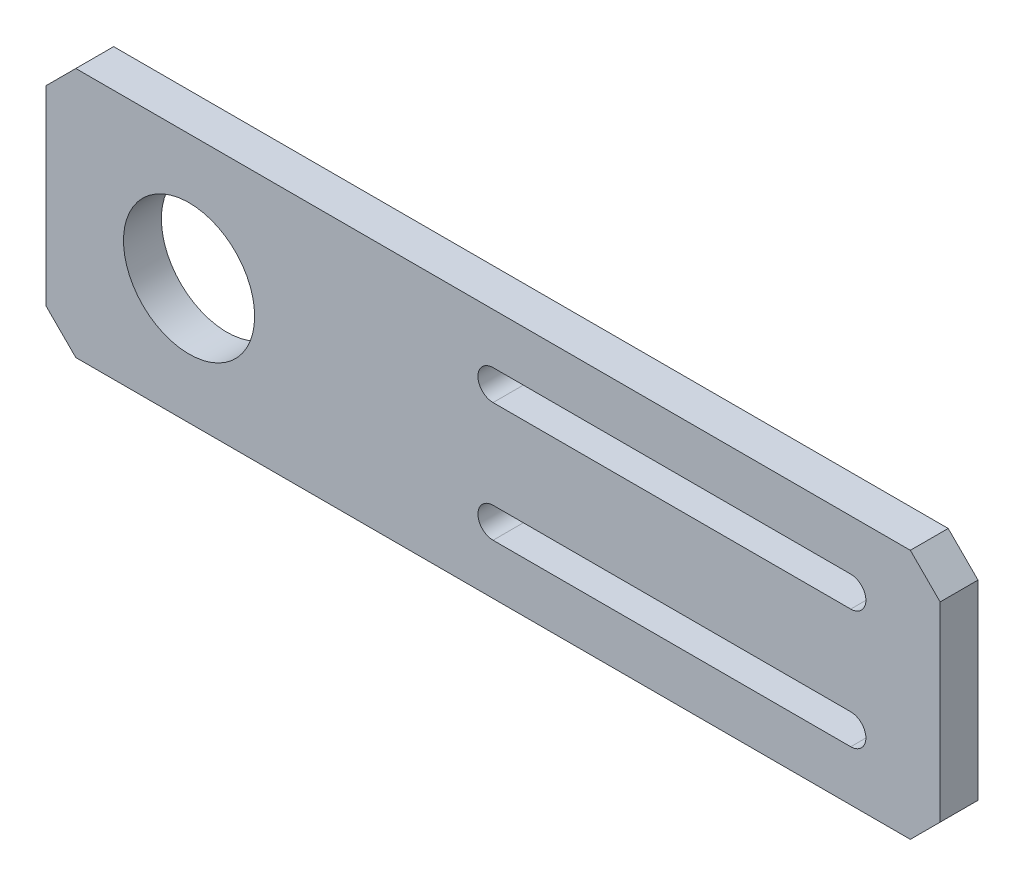
ISO-10303-21;
HEADER;
FILE_DESCRIPTION(('STEP AP214'),'2;1');
FILE_NAME('part.step','',(''),(''),'','','');
FILE_SCHEMA(('AUTOMOTIVE_DESIGN { 1 0 10303 214 1 1 1 1 }'));
ENDSEC;
DATA;
#1=APPLICATION_CONTEXT('core data for automotive mechanical design processes');
#2=APPLICATION_PROTOCOL_DEFINITION('international standard','automotive_design',2000,#1);
#3=PRODUCT_CONTEXT('',#1,'mechanical');
#4=PRODUCT('Part','Part','',(#3));
#5=PRODUCT_RELATED_PRODUCT_CATEGORY('part','',(#4));
#6=PRODUCT_DEFINITION_FORMATION('','',#4);
#7=PRODUCT_DEFINITION_CONTEXT('part definition',#1,'design');
#8=PRODUCT_DEFINITION('design','',#6,#7);
#9=PRODUCT_DEFINITION_SHAPE('','',#8);
#10=(LENGTH_UNIT() NAMED_UNIT(*) SI_UNIT(.MILLI.,.METRE.));
#11=(NAMED_UNIT(*) PLANE_ANGLE_UNIT() SI_UNIT($,.RADIAN.));
#12=(NAMED_UNIT(*) SI_UNIT($,.STERADIAN.) SOLID_ANGLE_UNIT());
#13=UNCERTAINTY_MEASURE_WITH_UNIT(LENGTH_MEASURE(1.E-05),#10,'distance_accuracy_value','');
#14=(GEOMETRIC_REPRESENTATION_CONTEXT(3) GLOBAL_UNCERTAINTY_ASSIGNED_CONTEXT((#13)) GLOBAL_UNIT_ASSIGNED_CONTEXT((#10,
#11,#12)) REPRESENTATION_CONTEXT('',''));
#15=CARTESIAN_POINT('',(0.,0.,0.));
#16=DIRECTION('',(0.,0.,1.));
#17=DIRECTION('',(1.,0.,0.));
#18=AXIS2_PLACEMENT_3D('',#15,#16,#17);
#19=CARTESIAN_POINT('',(0.,0.,6.35));
#20=DIRECTION('',(0.,0.,1.));
#21=DIRECTION('',(1.,0.,0.));
#22=AXIS2_PLACEMENT_3D('',#19,#20,#21);
#23=PLANE('',#22);
#24=DIRECTION('',(0.707106781186547,-0.707106781186548,0.));
#25=VECTOR('',#24,1.);
#26=CARTESIAN_POINT('',(31.75,31.75,6.35));
#27=LINE('',#26,#25);
#28=CARTESIAN_POINT('',(42.5,21.,6.35));
#29=VERTEX_POINT('',#28);
#30=CARTESIAN_POINT('',(47.5,16.,6.35));
#31=VERTEX_POINT('',#30);
#32=EDGE_CURVE('E158',#29,#31,#27,.T.);
#33=ORIENTED_EDGE('',*,*,#32,.F.);
#34=DIRECTION('',(-1.,0.,0.));
#35=VECTOR('',#34,1.);
#36=CARTESIAN_POINT('',(-102.5,21.,6.35));
#37=LINE('',#36,#35);
#38=CARTESIAN_POINT('',(-97.5,21.,6.35));
#39=VERTEX_POINT('',#38);
#40=EDGE_CURVE('E223',#29,#39,#37,.T.);
#41=ORIENTED_EDGE('',*,*,#40,.T.);
#42=DIRECTION('',(0.707106781186548,0.707106781186548,0.));
#43=VECTOR('',#42,1.);
#44=CARTESIAN_POINT('',(-59.25,59.25,6.35));
#45=LINE('',#44,#43);
#46=CARTESIAN_POINT('',(-102.5,16.,6.35));
#47=VERTEX_POINT('',#46);
#48=EDGE_CURVE('E251',#39,#47,#45,.F.);
#49=ORIENTED_EDGE('',*,*,#48,.T.);
#50=DIRECTION('',(0.,-1.,0.));
#51=VECTOR('',#50,1.);
#52=CARTESIAN_POINT('',(-102.5,21.,6.35));
#53=LINE('',#52,#51);
#54=CARTESIAN_POINT('',(-102.5,-16.,6.35));
#55=VERTEX_POINT('',#54);
#56=EDGE_CURVE('E225',#47,#55,#53,.T.);
#57=ORIENTED_EDGE('',*,*,#56,.T.);
#58=DIRECTION('',(-0.707106781186548,0.707106781186548,0.));
#59=VECTOR('',#58,1.);
#60=CARTESIAN_POINT('',(-59.25,-59.25,6.35));
#61=LINE('',#60,#59);
#62=CARTESIAN_POINT('',(-97.5,-21.,6.35));
#63=VERTEX_POINT('',#62);
#64=EDGE_CURVE('E249',#55,#63,#61,.F.);
#65=ORIENTED_EDGE('',*,*,#64,.T.);
#66=DIRECTION('',(1.,0.,0.));
#67=VECTOR('',#66,1.);
#68=CARTESIAN_POINT('',(-102.5,-21.,6.35));
#69=LINE('',#68,#67);
#70=CARTESIAN_POINT('',(42.5,-21.,6.35));
#71=VERTEX_POINT('',#70);
#72=EDGE_CURVE('E173',#63,#71,#69,.T.);
#73=ORIENTED_EDGE('',*,*,#72,.T.);
#74=DIRECTION('',(-0.707106781186547,-0.707106781186548,0.));
#75=VECTOR('',#74,1.);
#76=CARTESIAN_POINT('',(31.75,-31.75,6.35));
#77=LINE('',#76,#75);
#78=CARTESIAN_POINT('',(47.5,-16.,6.35));
#79=VERTEX_POINT('',#78);
#80=EDGE_CURVE('E151',#79,#71,#77,.T.);
#81=ORIENTED_EDGE('',*,*,#80,.F.);
#82=DIRECTION('',(0.,-1.,0.));
#83=VECTOR('',#82,1.);
#84=CARTESIAN_POINT('',(47.5,0.,6.35));
#85=LINE('',#84,#83);
#86=EDGE_CURVE('E161',#31,#79,#85,.T.);
#87=ORIENTED_EDGE('',*,*,#86,.F.);
#88=EDGE_LOOP('',(#33,#41,#49,#57,#65,#73,#81,#87));
#89=FACE_BOUND('',#88,.T.);
#90=DIRECTION('',(1.,0.,0.));
#91=VECTOR('',#90,1.);
#92=CARTESIAN_POINT('',(0.,7.46,6.35));
#93=LINE('',#92,#91);
#94=CARTESIAN_POINT('',(-27.5,7.46,6.35));
#95=VERTEX_POINT('',#94);
#96=CARTESIAN_POINT('',(32.5,7.46,6.35));
#97=VERTEX_POINT('',#96);
#98=EDGE_CURVE('E48',#95,#97,#93,.T.);
#99=ORIENTED_EDGE('',*,*,#98,.F.);
#100=CARTESIAN_POINT('',(-27.5,10.,6.35));
#101=DIRECTION('',(0.,0.,1.));
#102=DIRECTION('',(1.,0.,0.));
#103=AXIS2_PLACEMENT_3D('',#100,#101,#102);
#104=CIRCLE('',#103,2.54);
#105=CARTESIAN_POINT('',(-27.5,12.54,6.35));
#106=VERTEX_POINT('',#105);
#107=EDGE_CURVE('E190',#106,#95,#104,.T.);
#108=ORIENTED_EDGE('',*,*,#107,.F.);
#109=DIRECTION('',(1.,0.,0.));
#110=VECTOR('',#109,1.);
#111=CARTESIAN_POINT('',(0.,12.54,6.35));
#112=LINE('',#111,#110);
#113=CARTESIAN_POINT('',(32.5,12.54,6.35));
#114=VERTEX_POINT('',#113);
#115=EDGE_CURVE('E187',#106,#114,#112,.T.);
#116=ORIENTED_EDGE('',*,*,#115,.T.);
#117=CARTESIAN_POINT('',(32.5,10.,6.35));
#118=DIRECTION('',(0.,0.,1.));
#119=DIRECTION('',(1.,0.,0.));
#120=AXIS2_PLACEMENT_3D('',#117,#118,#119);
#121=CIRCLE('',#120,2.54);
#122=EDGE_CURVE('E183',#97,#114,#121,.T.);
#123=ORIENTED_EDGE('',*,*,#122,.F.);
#124=EDGE_LOOP('',(#99,#108,#116,#123));
#125=FACE_BOUND('',#124,.T.);
#126=CARTESIAN_POINT('',(-78.5,0.,6.35));
#127=DIRECTION('',(0.,0.,1.));
#128=DIRECTION('',(1.,0.,0.));
#129=AXIS2_PLACEMENT_3D('',#126,#127,#128);
#130=CIRCLE('',#129,11.);
#131=CARTESIAN_POINT('',(-67.5,0.,6.35));
#132=VERTEX_POINT('',#131);
#133=EDGE_CURVE('E178',#132,#132,#130,.T.);
#134=ORIENTED_EDGE('',*,*,#133,.F.);
#135=EDGE_LOOP('',(#134));
#136=FACE_BOUND('',#135,.T.);
#137=DIRECTION('',(1.,0.,0.));
#138=VECTOR('',#137,1.);
#139=CARTESIAN_POINT('',(0.,-7.46,6.35));
#140=LINE('',#139,#138);
#141=CARTESIAN_POINT('',(-27.5,-7.46,6.35));
#142=VERTEX_POINT('',#141);
#143=CARTESIAN_POINT('',(32.5,-7.46000000000001,6.35));
#144=VERTEX_POINT('',#143);
#145=EDGE_CURVE('E201',#142,#144,#140,.T.);
#146=ORIENTED_EDGE('',*,*,#145,.T.);
#147=CARTESIAN_POINT('',(32.5,-10.,6.35));
#148=DIRECTION('',(0.,0.,1.));
#149=DIRECTION('',(1.,0.,0.));
#150=AXIS2_PLACEMENT_3D('',#147,#148,#149);
#151=CIRCLE('',#150,2.54);
#152=CARTESIAN_POINT('',(32.5,-12.54,6.35));
#153=VERTEX_POINT('',#152);
#154=EDGE_CURVE('E56',#144,#153,#151,.F.);
#155=ORIENTED_EDGE('',*,*,#154,.T.);
#156=DIRECTION('',(1.,0.,0.));
#157=VECTOR('',#156,1.);
#158=CARTESIAN_POINT('',(0.,-12.54,6.35));
#159=LINE('',#158,#157);
#160=CARTESIAN_POINT('',(-27.5,-12.54,6.35));
#161=VERTEX_POINT('',#160);
#162=EDGE_CURVE('E207',#161,#153,#159,.T.);
#163=ORIENTED_EDGE('',*,*,#162,.F.);
#164=CARTESIAN_POINT('',(-27.5,-10.,6.35));
#165=DIRECTION('',(0.,0.,1.));
#166=DIRECTION('',(1.,0.,0.));
#167=AXIS2_PLACEMENT_3D('',#164,#165,#166);
#168=CIRCLE('',#167,2.54);
#169=EDGE_CURVE('E204',#161,#142,#168,.F.);
#170=ORIENTED_EDGE('',*,*,#169,.T.);
#171=EDGE_LOOP('',(#146,#155,#163,#170));
#172=FACE_BOUND('',#171,.T.);
#173=ADVANCED_FACE('F33',(#89,#125,#136,#172),#23,.T.);
#174=CARTESIAN_POINT('',(0.,0.,0.));
#175=DIRECTION('',(0.,0.,1.));
#176=DIRECTION('',(1.,0.,0.));
#177=AXIS2_PLACEMENT_3D('',#174,#175,#176);
#178=PLANE('',#177);
#179=CARTESIAN_POINT('',(-27.5,10.,0.));
#180=DIRECTION('',(0.,0.,1.));
#181=DIRECTION('',(1.,0.,0.));
#182=AXIS2_PLACEMENT_3D('',#179,#180,#181);
#183=CIRCLE('',#182,2.54);
#184=CARTESIAN_POINT('',(-27.5,12.54,0.));
#185=VERTEX_POINT('',#184);
#186=CARTESIAN_POINT('',(-27.5,7.46,0.));
#187=VERTEX_POINT('',#186);
#188=EDGE_CURVE('E272',#185,#187,#183,.T.);
#189=ORIENTED_EDGE('',*,*,#188,.T.);
#190=DIRECTION('',(1.,0.,0.));
#191=VECTOR('',#190,1.);
#192=CARTESIAN_POINT('',(0.,7.46,0.));
#193=LINE('',#192,#191);
#194=CARTESIAN_POINT('',(32.5,7.46,0.));
#195=VERTEX_POINT('',#194);
#196=EDGE_CURVE('E275',#187,#195,#193,.T.);
#197=ORIENTED_EDGE('',*,*,#196,.T.);
#198=CARTESIAN_POINT('',(32.5,10.,0.));
#199=DIRECTION('',(0.,0.,1.));
#200=DIRECTION('',(1.,0.,0.));
#201=AXIS2_PLACEMENT_3D('',#198,#199,#200);
#202=CIRCLE('',#201,2.54);
#203=CARTESIAN_POINT('',(32.5,12.54,0.));
#204=VERTEX_POINT('',#203);
#205=EDGE_CURVE('E266',#195,#204,#202,.T.);
#206=ORIENTED_EDGE('',*,*,#205,.T.);
#207=DIRECTION('',(1.,0.,0.));
#208=VECTOR('',#207,1.);
#209=CARTESIAN_POINT('',(0.,12.54,0.));
#210=LINE('',#209,#208);
#211=EDGE_CURVE('E269',#185,#204,#210,.T.);
#212=ORIENTED_EDGE('',*,*,#211,.F.);
#213=EDGE_LOOP('',(#189,#197,#206,#212));
#214=FACE_BOUND('',#213,.T.);
#215=DIRECTION('',(-1.,0.,0.));
#216=VECTOR('',#215,1.);
#217=CARTESIAN_POINT('',(-102.5,21.,0.));
#218=LINE('',#217,#216);
#219=CARTESIAN_POINT('',(42.5,21.,0.));
#220=VERTEX_POINT('',#219);
#221=CARTESIAN_POINT('',(-97.5,21.,0.));
#222=VERTEX_POINT('',#221);
#223=EDGE_CURVE('E220',#220,#222,#218,.T.);
#224=ORIENTED_EDGE('',*,*,#223,.F.);
#225=DIRECTION('',(0.707106781186547,-0.707106781186548,0.));
#226=VECTOR('',#225,1.);
#227=CARTESIAN_POINT('',(31.75,31.75,0.));
#228=LINE('',#227,#226);
#229=CARTESIAN_POINT('',(47.5,16.,0.));
#230=VERTEX_POINT('',#229);
#231=EDGE_CURVE('E11',#220,#230,#228,.T.);
#232=ORIENTED_EDGE('',*,*,#231,.T.);
#233=DIRECTION('',(0.,-1.,0.));
#234=VECTOR('',#233,1.);
#235=CARTESIAN_POINT('',(47.5,0.,0.));
#236=LINE('',#235,#234);
#237=CARTESIAN_POINT('',(47.5,-16.,0.));
#238=VERTEX_POINT('',#237);
#239=EDGE_CURVE('E41',#230,#238,#236,.T.);
#240=ORIENTED_EDGE('',*,*,#239,.T.);
#241=DIRECTION('',(-0.707106781186547,-0.707106781186548,0.));
#242=VECTOR('',#241,1.);
#243=CARTESIAN_POINT('',(31.75,-31.75,0.));
#244=LINE('',#243,#242);
#245=CARTESIAN_POINT('',(42.5,-21.,0.));
#246=VERTEX_POINT('',#245);
#247=EDGE_CURVE('E154',#238,#246,#244,.T.);
#248=ORIENTED_EDGE('',*,*,#247,.T.);
#249=DIRECTION('',(1.,0.,0.));
#250=VECTOR('',#249,1.);
#251=CARTESIAN_POINT('',(-102.5,-21.,0.));
#252=LINE('',#251,#250);
#253=CARTESIAN_POINT('',(-97.5,-21.,0.));
#254=VERTEX_POINT('',#253);
#255=EDGE_CURVE('E226',#254,#246,#252,.T.);
#256=ORIENTED_EDGE('',*,*,#255,.F.);
#257=DIRECTION('',(0.707106781186548,-0.707106781186548,0.));
#258=VECTOR('',#257,1.);
#259=CARTESIAN_POINT('',(-97.5,-21.,0.));
#260=LINE('',#259,#258);
#261=CARTESIAN_POINT('',(-102.5,-16.,0.));
#262=VERTEX_POINT('',#261);
#263=EDGE_CURVE('E241',#254,#262,#260,.F.);
#264=ORIENTED_EDGE('',*,*,#263,.T.);
#265=DIRECTION('',(0.,-1.,0.));
#266=VECTOR('',#265,1.);
#267=CARTESIAN_POINT('',(-102.5,21.,0.));
#268=LINE('',#267,#266);
#269=CARTESIAN_POINT('',(-102.5,16.,0.));
#270=VERTEX_POINT('',#269);
#271=EDGE_CURVE('E232',#270,#262,#268,.T.);
#272=ORIENTED_EDGE('',*,*,#271,.F.);
#273=DIRECTION('',(-0.707106781186548,-0.707106781186548,0.));
#274=VECTOR('',#273,1.);
#275=CARTESIAN_POINT('',(-102.5,16.,0.));
#276=LINE('',#275,#274);
#277=EDGE_CURVE('E243',#270,#222,#276,.F.);
#278=ORIENTED_EDGE('',*,*,#277,.T.);
#279=EDGE_LOOP('',(#224,#232,#240,#248,#256,#264,#272,#278));
#280=FACE_BOUND('',#279,.T.);
#281=CARTESIAN_POINT('',(-78.5,0.,0.));
#282=DIRECTION('',(0.,0.,1.));
#283=DIRECTION('',(1.,0.,0.));
#284=AXIS2_PLACEMENT_3D('',#281,#282,#283);
#285=CIRCLE('',#284,11.);
#286=CARTESIAN_POINT('',(-67.5,0.,0.));
#287=VERTEX_POINT('',#286);
#288=EDGE_CURVE('E217',#287,#287,#285,.T.);
#289=ORIENTED_EDGE('',*,*,#288,.T.);
#290=EDGE_LOOP('',(#289));
#291=FACE_BOUND('',#290,.T.);
#292=CARTESIAN_POINT('',(32.5,-10.,0.));
#293=DIRECTION('',(0.,0.,1.));
#294=DIRECTION('',(1.,0.,0.));
#295=AXIS2_PLACEMENT_3D('',#292,#293,#294);
#296=CIRCLE('',#295,2.54);
#297=CARTESIAN_POINT('',(32.5,-7.46000000000001,0.));
#298=VERTEX_POINT('',#297);
#299=CARTESIAN_POINT('',(32.5,-12.54,0.));
#300=VERTEX_POINT('',#299);
#301=EDGE_CURVE('E264',#298,#300,#296,.F.);
#302=ORIENTED_EDGE('',*,*,#301,.F.);
#303=DIRECTION('',(1.,0.,0.));
#304=VECTOR('',#303,1.);
#305=CARTESIAN_POINT('',(0.,-7.46,0.));
#306=LINE('',#305,#304);
#307=CARTESIAN_POINT('',(-27.5,-7.46,0.));
#308=VERTEX_POINT('',#307);
#309=EDGE_CURVE('E256',#308,#298,#306,.T.);
#310=ORIENTED_EDGE('',*,*,#309,.F.);
#311=CARTESIAN_POINT('',(-27.5,-10.,0.));
#312=DIRECTION('',(0.,0.,1.));
#313=DIRECTION('',(1.,0.,0.));
#314=AXIS2_PLACEMENT_3D('',#311,#312,#313);
#315=CIRCLE('',#314,2.54);
#316=CARTESIAN_POINT('',(-27.5,-12.54,0.));
#317=VERTEX_POINT('',#316);
#318=EDGE_CURVE('E258',#317,#308,#315,.F.);
#319=ORIENTED_EDGE('',*,*,#318,.F.);
#320=DIRECTION('',(1.,0.,0.));
#321=VECTOR('',#320,1.);
#322=CARTESIAN_POINT('',(0.,-12.54,0.));
#323=LINE('',#322,#321);
#324=EDGE_CURVE('E261',#317,#300,#323,.T.);
#325=ORIENTED_EDGE('',*,*,#324,.T.);
#326=EDGE_LOOP('',(#302,#310,#319,#325));
#327=FACE_BOUND('',#326,.T.);
#328=ADVANCED_FACE('F280',(#214,#280,#291,#327),#178,.F.);
#329=CARTESIAN_POINT('',(-102.5,21.,6.35));
#330=DIRECTION('',(0.,-1.,0.));
#331=DIRECTION('',(0.,0.,-1.));
#332=AXIS2_PLACEMENT_3D('',#329,#330,#331);
#333=PLANE('',#332);
#334=ORIENTED_EDGE('',*,*,#40,.F.);
#335=DIRECTION('',(0.,0.,1.));
#336=VECTOR('',#335,1.);
#337=CARTESIAN_POINT('',(42.5,21.,-3.65));
#338=LINE('',#337,#336);
#339=EDGE_CURVE('E179',#220,#29,#338,.T.);
#340=ORIENTED_EDGE('',*,*,#339,.F.);
#341=ORIENTED_EDGE('',*,*,#223,.T.);
#342=DIRECTION('',(0.,0.,1.));
#343=VECTOR('',#342,1.);
#344=CARTESIAN_POINT('',(-97.5,21.,6.35));
#345=LINE('',#344,#343);
#346=EDGE_CURVE('E246',#222,#39,#345,.T.);
#347=ORIENTED_EDGE('',*,*,#346,.T.);
#348=EDGE_LOOP('',(#334,#340,#341,#347));
#349=FACE_BOUND('',#348,.T.);
#350=ADVANCED_FACE('F288',(#349),#333,.F.);
#351=CARTESIAN_POINT('',(-102.5,21.,6.35));
#352=DIRECTION('',(1.,0.,0.));
#353=DIRECTION('',(0.,0.,-1.));
#354=AXIS2_PLACEMENT_3D('',#351,#352,#353);
#355=PLANE('',#354);
#356=ORIENTED_EDGE('',*,*,#56,.F.);
#357=DIRECTION('',(0.,0.,-1.));
#358=VECTOR('',#357,1.);
#359=CARTESIAN_POINT('',(-102.5,16.,6.35));
#360=LINE('',#359,#358);
#361=EDGE_CURVE('E238',#47,#270,#360,.T.);
#362=ORIENTED_EDGE('',*,*,#361,.T.);
#363=ORIENTED_EDGE('',*,*,#271,.T.);
#364=DIRECTION('',(0.,0.,1.));
#365=VECTOR('',#364,1.);
#366=CARTESIAN_POINT('',(-102.5,-16.0000000000001,6.35));
#367=LINE('',#366,#365);
#368=EDGE_CURVE('E230',#262,#55,#367,.T.);
#369=ORIENTED_EDGE('',*,*,#368,.T.);
#370=EDGE_LOOP('',(#356,#362,#363,#369));
#371=FACE_BOUND('',#370,.T.);
#372=ADVANCED_FACE('F297',(#371),#355,.F.);
#373=CARTESIAN_POINT('',(-102.5,-21.,6.35));
#374=DIRECTION('',(0.,1.,0.));
#375=DIRECTION('',(0.,0.,1.));
#376=AXIS2_PLACEMENT_3D('',#373,#374,#375);
#377=PLANE('',#376);
#378=ORIENTED_EDGE('',*,*,#255,.T.);
#379=DIRECTION('',(0.,0.,1.));
#380=VECTOR('',#379,1.);
#381=CARTESIAN_POINT('',(42.5,-21.,-3.65));
#382=LINE('',#381,#380);
#383=EDGE_CURVE('E157',#246,#71,#382,.T.);
#384=ORIENTED_EDGE('',*,*,#383,.T.);
#385=ORIENTED_EDGE('',*,*,#72,.F.);
#386=DIRECTION('',(0.,0.,-1.));
#387=VECTOR('',#386,1.);
#388=CARTESIAN_POINT('',(-97.5,-21.,6.35));
#389=LINE('',#388,#387);
#390=EDGE_CURVE('E253',#63,#254,#389,.T.);
#391=ORIENTED_EDGE('',*,*,#390,.T.);
#392=EDGE_LOOP('',(#378,#384,#385,#391));
#393=FACE_BOUND('',#392,.T.);
#394=ADVANCED_FACE('F303',(#393),#377,.F.);
#395=CARTESIAN_POINT('',(-78.5,0.,0.));
#396=DIRECTION('',(0.,0.,1.));
#397=DIRECTION('',(1.,0.,0.));
#398=AXIS2_PLACEMENT_3D('',#395,#396,#397);
#399=CYLINDRICAL_SURFACE('',#398,11.);
#400=ORIENTED_EDGE('',*,*,#288,.F.);
#401=EDGE_LOOP('',(#400));
#402=FACE_BOUND('',#401,.T.);
#403=ORIENTED_EDGE('',*,*,#133,.T.);
#404=EDGE_LOOP('',(#403));
#405=FACE_BOUND('',#404,.T.);
#406=ADVANCED_FACE('F305',(#402,#405),#399,.F.);
#407=CARTESIAN_POINT('',(-102.5,16.,6.35));
#408=DIRECTION('',(0.707106781186547,-0.707106781186547,0.));
#409=DIRECTION('',(0.,0.,-1.));
#410=AXIS2_PLACEMENT_3D('',#407,#408,#409);
#411=PLANE('',#410);
#412=ORIENTED_EDGE('',*,*,#48,.F.);
#413=ORIENTED_EDGE('',*,*,#346,.F.);
#414=ORIENTED_EDGE('',*,*,#277,.F.);
#415=ORIENTED_EDGE('',*,*,#361,.F.);
#416=EDGE_LOOP('',(#412,#413,#414,#415));
#417=FACE_BOUND('',#416,.T.);
#418=ADVANCED_FACE('F293',(#417),#411,.F.);
#419=CARTESIAN_POINT('',(-97.5,-21.,6.35));
#420=DIRECTION('',(0.707106781186547,0.707106781186547,0.));
#421=DIRECTION('',(0.,0.,-1.));
#422=AXIS2_PLACEMENT_3D('',#419,#420,#421);
#423=PLANE('',#422);
#424=ORIENTED_EDGE('',*,*,#64,.F.);
#425=ORIENTED_EDGE('',*,*,#368,.F.);
#426=ORIENTED_EDGE('',*,*,#263,.F.);
#427=ORIENTED_EDGE('',*,*,#390,.F.);
#428=EDGE_LOOP('',(#424,#425,#426,#427));
#429=FACE_BOUND('',#428,.T.);
#430=ADVANCED_FACE('F35',(#429),#423,.F.);
#431=CARTESIAN_POINT('',(32.5,-10.,-3.65));
#432=DIRECTION('',(0.,0.,1.));
#433=DIRECTION('',(1.,0.,0.));
#434=AXIS2_PLACEMENT_3D('',#431,#432,#433);
#435=CYLINDRICAL_SURFACE('',#434,2.54);
#436=ORIENTED_EDGE('',*,*,#301,.T.);
#437=DIRECTION('',(0.,0.,1.));
#438=VECTOR('',#437,1.);
#439=CARTESIAN_POINT('',(32.5,-12.54,-3.65));
#440=LINE('',#439,#438);
#441=EDGE_CURVE('E184',#300,#153,#440,.T.);
#442=ORIENTED_EDGE('',*,*,#441,.T.);
#443=ORIENTED_EDGE('',*,*,#154,.F.);
#444=DIRECTION('',(0.,0.,1.));
#445=VECTOR('',#444,1.);
#446=CARTESIAN_POINT('',(32.5,-7.46000000000001,-3.65));
#447=LINE('',#446,#445);
#448=EDGE_CURVE('E210',#298,#144,#447,.T.);
#449=ORIENTED_EDGE('',*,*,#448,.F.);
#450=EDGE_LOOP('',(#436,#442,#443,#449));
#451=FACE_BOUND('',#450,.T.);
#452=ADVANCED_FACE('F322',(#451),#435,.F.);
#453=CARTESIAN_POINT('',(0.,-12.54,-3.65));
#454=DIRECTION('',(0.,-1.,0.));
#455=DIRECTION('',(1.,0.,0.));
#456=AXIS2_PLACEMENT_3D('',#453,#454,#455);
#457=PLANE('',#456);
#458=DIRECTION('',(0.,0.,1.));
#459=VECTOR('',#458,1.);
#460=CARTESIAN_POINT('',(-27.5,-12.54,-3.65));
#461=LINE('',#460,#459);
#462=EDGE_CURVE('E212',#317,#161,#461,.T.);
#463=ORIENTED_EDGE('',*,*,#462,.T.);
#464=ORIENTED_EDGE('',*,*,#162,.T.);
#465=ORIENTED_EDGE('',*,*,#441,.F.);
#466=ORIENTED_EDGE('',*,*,#324,.F.);
#467=EDGE_LOOP('',(#463,#464,#465,#466));
#468=FACE_BOUND('',#467,.T.);
#469=ADVANCED_FACE('F325',(#468),#457,.F.);
#470=CARTESIAN_POINT('',(-27.5,-10.,-3.65));
#471=DIRECTION('',(0.,0.,1.));
#472=DIRECTION('',(1.,0.,0.));
#473=AXIS2_PLACEMENT_3D('',#470,#471,#472);
#474=CYLINDRICAL_SURFACE('',#473,2.54);
#475=ORIENTED_EDGE('',*,*,#318,.T.);
#476=DIRECTION('',(0.,0.,1.));
#477=VECTOR('',#476,1.);
#478=CARTESIAN_POINT('',(-27.5,-7.46,-3.65));
#479=LINE('',#478,#477);
#480=EDGE_CURVE('E214',#308,#142,#479,.T.);
#481=ORIENTED_EDGE('',*,*,#480,.T.);
#482=ORIENTED_EDGE('',*,*,#169,.F.);
#483=ORIENTED_EDGE('',*,*,#462,.F.);
#484=EDGE_LOOP('',(#475,#481,#482,#483));
#485=FACE_BOUND('',#484,.T.);
#486=ADVANCED_FACE('F330',(#485),#474,.F.);
#487=CARTESIAN_POINT('',(0.,-7.46,-3.65));
#488=DIRECTION('',(0.,-1.,0.));
#489=DIRECTION('',(1.,0.,0.));
#490=AXIS2_PLACEMENT_3D('',#487,#488,#489);
#491=PLANE('',#490);
#492=ORIENTED_EDGE('',*,*,#309,.T.);
#493=ORIENTED_EDGE('',*,*,#448,.T.);
#494=ORIENTED_EDGE('',*,*,#145,.F.);
#495=ORIENTED_EDGE('',*,*,#480,.F.);
#496=EDGE_LOOP('',(#492,#493,#494,#495));
#497=FACE_BOUND('',#496,.T.);
#498=ADVANCED_FACE('F326',(#497),#491,.T.);
#499=CARTESIAN_POINT('',(0.,7.46,-3.65));
#500=DIRECTION('',(0.,-1.,0.));
#501=DIRECTION('',(1.,0.,0.));
#502=AXIS2_PLACEMENT_3D('',#499,#500,#501);
#503=PLANE('',#502);
#504=DIRECTION('',(0.,0.,1.));
#505=VECTOR('',#504,1.);
#506=CARTESIAN_POINT('',(-27.5,7.46,-3.65));
#507=LINE('',#506,#505);
#508=EDGE_CURVE('E168',#187,#95,#507,.T.);
#509=ORIENTED_EDGE('',*,*,#508,.T.);
#510=ORIENTED_EDGE('',*,*,#98,.T.);
#511=DIRECTION('',(0.,0.,1.));
#512=VECTOR('',#511,1.);
#513=CARTESIAN_POINT('',(32.5,7.46,-3.65));
#514=LINE('',#513,#512);
#515=EDGE_CURVE('E193',#195,#97,#514,.T.);
#516=ORIENTED_EDGE('',*,*,#515,.F.);
#517=ORIENTED_EDGE('',*,*,#196,.F.);
#518=EDGE_LOOP('',(#509,#510,#516,#517));
#519=FACE_BOUND('',#518,.T.);
#520=ADVANCED_FACE('F329',(#519),#503,.F.);
#521=CARTESIAN_POINT('',(-27.5,10.,-3.65));
#522=DIRECTION('',(0.,0.,1.));
#523=DIRECTION('',(1.,0.,0.));
#524=AXIS2_PLACEMENT_3D('',#521,#522,#523);
#525=CYLINDRICAL_SURFACE('',#524,2.54);
#526=DIRECTION('',(0.,0.,1.));
#527=VECTOR('',#526,1.);
#528=CARTESIAN_POINT('',(-27.5,12.54,-3.65));
#529=LINE('',#528,#527);
#530=EDGE_CURVE('E195',#185,#106,#529,.T.);
#531=ORIENTED_EDGE('',*,*,#530,.T.);
#532=ORIENTED_EDGE('',*,*,#107,.T.);
#533=ORIENTED_EDGE('',*,*,#508,.F.);
#534=ORIENTED_EDGE('',*,*,#188,.F.);
#535=EDGE_LOOP('',(#531,#532,#533,#534));
#536=FACE_BOUND('',#535,.T.);
#537=ADVANCED_FACE('F340',(#536),#525,.F.);
#538=CARTESIAN_POINT('',(0.,12.54,-3.65));
#539=DIRECTION('',(0.,-1.,0.));
#540=DIRECTION('',(1.,0.,0.));
#541=AXIS2_PLACEMENT_3D('',#538,#539,#540);
#542=PLANE('',#541);
#543=ORIENTED_EDGE('',*,*,#211,.T.);
#544=DIRECTION('',(0.,0.,1.));
#545=VECTOR('',#544,1.);
#546=CARTESIAN_POINT('',(32.5,12.54,-3.65));
#547=LINE('',#546,#545);
#548=EDGE_CURVE('E197',#204,#114,#547,.T.);
#549=ORIENTED_EDGE('',*,*,#548,.T.);
#550=ORIENTED_EDGE('',*,*,#115,.F.);
#551=ORIENTED_EDGE('',*,*,#530,.F.);
#552=EDGE_LOOP('',(#543,#549,#550,#551));
#553=FACE_BOUND('',#552,.T.);
#554=ADVANCED_FACE('F344',(#553),#542,.T.);
#555=CARTESIAN_POINT('',(32.5,10.,-3.65));
#556=DIRECTION('',(0.,0.,1.));
#557=DIRECTION('',(1.,0.,0.));
#558=AXIS2_PLACEMENT_3D('',#555,#556,#557);
#559=CYLINDRICAL_SURFACE('',#558,2.54);
#560=ORIENTED_EDGE('',*,*,#515,.T.);
#561=ORIENTED_EDGE('',*,*,#122,.T.);
#562=ORIENTED_EDGE('',*,*,#548,.F.);
#563=ORIENTED_EDGE('',*,*,#205,.F.);
#564=EDGE_LOOP('',(#560,#561,#562,#563));
#565=FACE_BOUND('',#564,.T.);
#566=ADVANCED_FACE('F341',(#565),#559,.F.);
#567=CARTESIAN_POINT('',(47.5,0.,-3.65));
#568=DIRECTION('',(-1.,0.,0.));
#569=DIRECTION('',(0.,0.,1.));
#570=AXIS2_PLACEMENT_3D('',#567,#568,#569);
#571=PLANE('',#570);
#572=DIRECTION('',(0.,0.,1.));
#573=VECTOR('',#572,1.);
#574=CARTESIAN_POINT('',(47.5,16.,-3.65));
#575=LINE('',#574,#573);
#576=EDGE_CURVE('E164',#230,#31,#575,.T.);
#577=ORIENTED_EDGE('',*,*,#576,.T.);
#578=ORIENTED_EDGE('',*,*,#86,.T.);
#579=DIRECTION('',(0.,0.,1.));
#580=VECTOR('',#579,1.);
#581=CARTESIAN_POINT('',(47.5,-16.,-3.65));
#582=LINE('',#581,#580);
#583=EDGE_CURVE('E147',#238,#79,#582,.T.);
#584=ORIENTED_EDGE('',*,*,#583,.F.);
#585=ORIENTED_EDGE('',*,*,#239,.F.);
#586=EDGE_LOOP('',(#577,#578,#584,#585));
#587=FACE_BOUND('',#586,.T.);
#588=ADVANCED_FACE('F162',(#587),#571,.F.);
#589=CARTESIAN_POINT('',(31.75,31.75,-3.65));
#590=DIRECTION('',(-0.707106781186548,-0.707106781186547,0.));
#591=DIRECTION('',(0.707106781186547,-0.707106781186548,0.));
#592=AXIS2_PLACEMENT_3D('',#589,#590,#591);
#593=PLANE('',#592);
#594=ORIENTED_EDGE('',*,*,#339,.T.);
#595=ORIENTED_EDGE('',*,*,#32,.T.);
#596=ORIENTED_EDGE('',*,*,#576,.F.);
#597=ORIENTED_EDGE('',*,*,#231,.F.);
#598=EDGE_LOOP('',(#594,#595,#596,#597));
#599=FACE_BOUND('',#598,.T.);
#600=ADVANCED_FACE('F284',(#599),#593,.F.);
#601=CARTESIAN_POINT('',(31.75,-31.75,-3.65));
#602=DIRECTION('',(-0.707106781186548,0.707106781186547,0.));
#603=DIRECTION('',(-0.707106781186547,-0.707106781186548,0.));
#604=AXIS2_PLACEMENT_3D('',#601,#602,#603);
#605=PLANE('',#604);
#606=ORIENTED_EDGE('',*,*,#583,.T.);
#607=ORIENTED_EDGE('',*,*,#80,.T.);
#608=ORIENTED_EDGE('',*,*,#383,.F.);
#609=ORIENTED_EDGE('',*,*,#247,.F.);
#610=EDGE_LOOP('',(#606,#607,#608,#609));
#611=FACE_BOUND('',#610,.T.);
#612=ADVANCED_FACE('F149',(#611),#605,.F.);
#613=CLOSED_SHELL('',(#173,#328,#350,#372,#394,#406,#418,#430,#452,#469,#486,#498,#520,#537,
#554,#566,#588,#600,#612));
#614=MANIFOLD_SOLID_BREP('B2',#613);
#615=ADVANCED_BREP_SHAPE_REPRESENTATION('',(#18,#614),#14);
#616=SHAPE_DEFINITION_REPRESENTATION(#9,#615);
ENDSEC;
END-ISO-10303-21;
